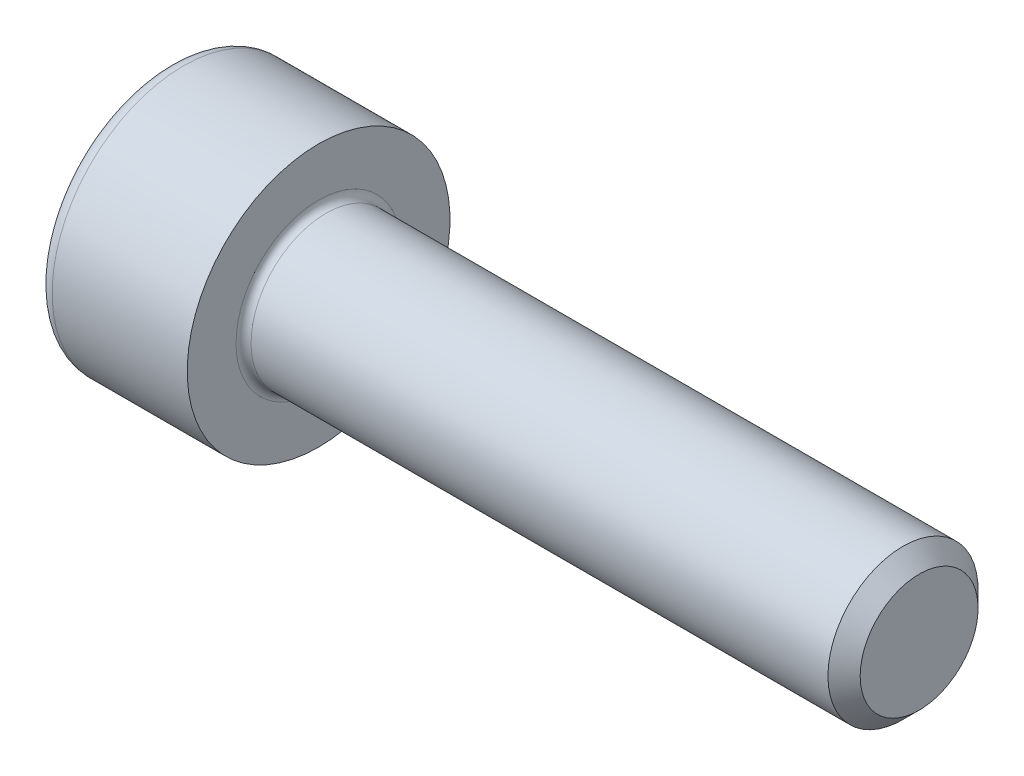
ISO-10303-21;
HEADER;
FILE_DESCRIPTION(('STEP AP214'),'2;1');
FILE_NAME('part.step','',(''),(''),'','','');
FILE_SCHEMA(('AUTOMOTIVE_DESIGN { 1 0 10303 214 1 1 1 1 }'));
ENDSEC;
DATA;
#1=APPLICATION_CONTEXT('core data for automotive mechanical design processes');
#2=APPLICATION_PROTOCOL_DEFINITION('international standard','automotive_design',2000,#1);
#3=PRODUCT_CONTEXT('',#1,'mechanical');
#4=PRODUCT('Part','Part','',(#3));
#5=PRODUCT_RELATED_PRODUCT_CATEGORY('part','',(#4));
#6=PRODUCT_DEFINITION_FORMATION('','',#4);
#7=PRODUCT_DEFINITION_CONTEXT('part definition',#1,'design');
#8=PRODUCT_DEFINITION('design','',#6,#7);
#9=PRODUCT_DEFINITION_SHAPE('','',#8);
#10=(LENGTH_UNIT() NAMED_UNIT(*) SI_UNIT(.MILLI.,.METRE.));
#11=(NAMED_UNIT(*) PLANE_ANGLE_UNIT() SI_UNIT($,.RADIAN.));
#12=(NAMED_UNIT(*) SI_UNIT($,.STERADIAN.) SOLID_ANGLE_UNIT());
#13=UNCERTAINTY_MEASURE_WITH_UNIT(LENGTH_MEASURE(1.E-05),#10,'distance_accuracy_value','');
#14=(GEOMETRIC_REPRESENTATION_CONTEXT(3) GLOBAL_UNCERTAINTY_ASSIGNED_CONTEXT((#13)) GLOBAL_UNIT_ASSIGNED_CONTEXT((#10,
#11,#12)) REPRESENTATION_CONTEXT('',''));
#15=CARTESIAN_POINT('',(0.,0.,0.));
#16=DIRECTION('',(0.,0.,1.));
#17=DIRECTION('',(1.,0.,0.));
#18=AXIS2_PLACEMENT_3D('',#15,#16,#17);
#19=CARTESIAN_POINT('',(-3.99999999999999,1.5,0.866025403784437));
#20=DIRECTION('',(0.,1.,0.));
#21=DIRECTION('',(0.,0.,1.));
#22=AXIS2_PLACEMENT_3D('',#19,#20,#21);
#23=PLANE('',#22);
#24=DIRECTION('',(0.,0.,1.));
#25=VECTOR('',#24,1.);
#26=CARTESIAN_POINT('',(-3.99999999999999,1.5,0.866025403784437));
#27=LINE('',#26,#25);
#28=CARTESIAN_POINT('',(-3.99999999999999,1.5,-0.86602540378444));
#29=VERTEX_POINT('',#28);
#30=CARTESIAN_POINT('',(-3.99999999999999,1.50000001434973,0.86602539549962));
#31=VERTEX_POINT('',#30);
#32=EDGE_CURVE('E70',#29,#31,#27,.T.);
#33=ORIENTED_EDGE('',*,*,#32,.F.);
#34=DIRECTION('',(1.,0.,0.));
#35=VECTOR('',#34,1.);
#36=CARTESIAN_POINT('',(-3.99999999999999,1.5,-0.86602540378444));
#37=LINE('',#36,#35);
#38=CARTESIAN_POINT('',(-2.00000000622813,1.5,-0.866025425314682));
#39=VERTEX_POINT('',#38);
#40=EDGE_CURVE('E127',#29,#39,#37,.T.);
#41=ORIENTED_EDGE('',*,*,#40,.T.);
#42=CARTESIAN_POINT('',(-2.00000001244337,1.5,-0.866025446844923));
#43=CARTESIAN_POINT('',(-1.97802167027363,1.5,-0.789912302852927));
#44=CARTESIAN_POINT('',(-1.9580335181738,1.5,-0.713142151286127));
#45=CARTESIAN_POINT('',(-1.92314479865285,1.5,-0.558272624278191));
#46=CARTESIAN_POINT('',(-1.9082565721912,1.5,-0.480170498000679));
#47=CARTESIAN_POINT('',(-1.88508197381883,1.5,-0.324934125856235));
#48=CARTESIAN_POINT('',(-1.87664134414548,1.5,-0.247823758405713));
#49=CARTESIAN_POINT('',(-1.86656687731368,1.5,-0.0932403829492778));
#50=CARTESIAN_POINT('',(-1.8649246956255,1.5,-0.015767936426523));
#51=CARTESIAN_POINT('',(-1.86834971575511,1.5,0.128981011060547));
#52=CARTESIAN_POINT('',(-1.87257596047736,1.5,0.196279232790937));
#53=CARTESIAN_POINT('',(-1.88596796804727,1.5,0.330437250414616));
#54=CARTESIAN_POINT('',(-1.89513830110027,1.5,0.397296582637759));
#55=CARTESIAN_POINT('',(-1.91806235931432,1.5,0.531730978506836));
#56=CARTESIAN_POINT('',(-1.93191321271813,1.5,0.599289036254629));
#57=CARTESIAN_POINT('',(-1.96334879473343,1.5,0.733397814913492));
#58=CARTESIAN_POINT('',(-1.98092614197712,1.5,0.79995025258687));
#59=CARTESIAN_POINT('',(-1.99999996661989,1.5,0.866025288107723));
#60=B_SPLINE_CURVE_WITH_KNOTS('',3,(#42,#43,#44,#45,#46,#47,#48,#49,#50,#51,#52,#53,#54,#55,#56,
#57,#58,#59),.UNSPECIFIED.,.F.,.F.,(4,2,2,2,2,2,2,2,4),(0.,0.237762011469281,0.47609536843425,
0.708530713118473,0.940680677999537,1.14278082713907,1.34506811427312,1.55184116347492,
1.75820840460591),.UNSPECIFIED.);
#61=CARTESIAN_POINT('',(-1.99999999088358,1.50000002270158,0.866025332839321));
#62=VERTEX_POINT('',#61);
#63=EDGE_CURVE('E63',#39,#62,#60,.T.);
#64=ORIENTED_EDGE('',*,*,#63,.T.);
#65=DIRECTION('',(1.,0.,0.));
#66=VECTOR('',#65,1.);
#67=CARTESIAN_POINT('',(-3.99999999999999,1.50000002152459,0.866025391357211));
#68=LINE('',#67,#66);
#69=EDGE_CURVE('E136',#62,#31,#68,.F.);
#70=ORIENTED_EDGE('',*,*,#69,.T.);
#71=EDGE_LOOP('',(#33,#41,#64,#70));
#72=FACE_BOUND('',#71,.T.);
#73=ADVANCED_FACE('F17',(#72),#23,.F.);
#74=CARTESIAN_POINT('',(-3.99999999999999,0.,1.73205080756888));
#75=DIRECTION('',(0.,0.500000000000001,0.866025403784438));
#76=DIRECTION('',(0.,-0.866025403784438,0.500000000000001));
#77=AXIS2_PLACEMENT_3D('',#74,#75,#76);
#78=PLANE('',#77);
#79=DIRECTION('',(0.,-0.866025403784438,0.500000000000001));
#80=VECTOR('',#79,1.);
#81=CARTESIAN_POINT('',(-3.99999999999999,0.,1.73205080756888));
#82=LINE('',#81,#80);
#83=CARTESIAN_POINT('',(-3.99999999999999,2.367900377615E-09,1.73205080893599));
#84=VERTEX_POINT('',#83);
#85=EDGE_CURVE('E138',#31,#84,#82,.T.);
#86=ORIENTED_EDGE('',*,*,#85,.F.);
#87=ORIENTED_EDGE('',*,*,#69,.F.);
#88=CARTESIAN_POINT('',(-1.99999999914628,2.59982219753588E-09,1.73205080606787));
#89=CARTESIAN_POINT('',(-1.97802165804949,0.065915918243952,1.69399423442685));
#90=CARTESIAN_POINT('',(-1.95803350709377,0.132400819134735,1.65560915900051));
#91=CARTESIAN_POINT('',(-1.92314478995667,0.266521762501426,1.57817439624379));
#92=CARTESIAN_POINT('',(-1.90825656473387,0.334160187271199,1.5391233334954));
#93=CARTESIAN_POINT('',(-1.88508196884754,0.46859882769027,1.46150514825996));
#94=CARTESIAN_POINT('',(-1.87664134041704,0.535378364025733,1.42294996498032));
#95=CARTESIAN_POINT('',(-1.86656687597428,0.669251492536777,1.34565827819721));
#96=CARTESIAN_POINT('',(-1.86492469543271,0.736344598453817,1.30692205543524));
#97=CARTESIAN_POINT('',(-1.86834971778716,0.861700872504675,1.23454757686737));
#98=CARTESIAN_POINT('',(-1.87257596451876,0.919982851361971,1.20089846068521));
#99=CARTESIAN_POINT('',(-1.88596797752577,1.03616712096001,1.13381944135718));
#100=CARTESIAN_POINT('',(-1.89513831400995,1.09406901015022,1.10038977004662));
#101=CARTESIAN_POINT('',(-1.91806238026255,1.21049263030154,1.03317256161222));
#102=CARTESIAN_POINT('',(-1.93191323831751,1.2689996337133,0.99939352744297));
#103=CARTESIAN_POINT('',(-1.96334883035755,1.38514126089747,0.932339127724068));
#104=CARTESIAN_POINT('',(-1.98092618296969,1.44277737143093,0.899062903792528));
#105=CARTESIAN_POINT('',(-2.00000001316396,1.50000003945322,0.866025381006112));
#106=B_SPLINE_CURVE_WITH_KNOTS('',3,(#88,#89,#90,#91,#92,#93,#94,#95,#96,#97,#98,#99,#100,#101,
#102,#103,#104,#105),.UNSPECIFIED.,.F.,.F.,(4,2,2,2,2,2,2,2,4),(0.,0.237762008525205,
0.476095362486668,0.708530704105071,0.940680665935181,1.14278084719831,1.3450681665734,
1.55184124967058,1.75820852442755),.UNSPECIFIED.);
#107=CARTESIAN_POINT('',(-2.00000000026003,2.1878736345942E-09,1.7320508079118));
#108=VERTEX_POINT('',#107);
#109=EDGE_CURVE('E139',#108,#62,#106,.T.);
#110=ORIENTED_EDGE('',*,*,#109,.F.);
#111=DIRECTION('',(1.,0.,0.));
#112=VECTOR('',#111,1.);
#113=CARTESIAN_POINT('',(-3.99999999999999,3.55185022019033E-09,1.73205080961954));
#114=LINE('',#113,#112);
#115=EDGE_CURVE('E118',#108,#84,#114,.F.);
#116=ORIENTED_EDGE('',*,*,#115,.T.);
#117=EDGE_LOOP('',(#86,#87,#110,#116));
#118=FACE_BOUND('',#117,.T.);
#119=ADVANCED_FACE('F200',(#118),#78,.F.);
#120=CARTESIAN_POINT('',(-3.99999999999999,1.5,-0.86602540378444));
#121=DIRECTION('',(0.,0.5,-0.866025403784439));
#122=DIRECTION('',(0.,0.866025403784439,0.5));
#123=AXIS2_PLACEMENT_3D('',#120,#121,#122);
#124=PLANE('',#123);
#125=DIRECTION('',(0.,0.866025403784439,0.5));
#126=VECTOR('',#125,1.);
#127=CARTESIAN_POINT('',(-3.99999999999999,1.5,-0.86602540378444));
#128=LINE('',#127,#126);
#129=CARTESIAN_POINT('',(-3.99999999999999,0.,-1.73205080756888));
#130=VERTEX_POINT('',#129);
#131=EDGE_CURVE('E129',#130,#29,#128,.T.);
#132=ORIENTED_EDGE('',*,*,#131,.F.);
#133=DIRECTION('',(1.,0.,0.));
#134=VECTOR('',#133,1.);
#135=CARTESIAN_POINT('',(-3.99999999999999,0.,-1.73205080756888));
#136=LINE('',#135,#134);
#137=CARTESIAN_POINT('',(-1.99999999617477,-2.59634794172114E-08,-1.73205080091443));
#138=VERTEX_POINT('',#137);
#139=EDGE_CURVE('E91',#130,#138,#136,.T.);
#140=ORIENTED_EDGE('',*,*,#139,.T.);
#141=CARTESIAN_POINT('',(-1.9999999845922,1.49999999398787,-0.86602542611703));
#142=CARTESIAN_POINT('',(-1.97802165051845,1.4340840727152,-0.904081988920401));
#143=CARTESIAN_POINT('',(-1.95803350279868,1.36759917014035,-0.942467060360441));
#144=CARTESIAN_POINT('',(-1.92314478868745,1.23347822682247,-1.01990181945342));
#145=CARTESIAN_POINT('',(-1.90825656325272,1.16583980379276,-1.05895288253534));
#146=CARTESIAN_POINT('',(-1.88508196765766,1.0314011657448,-1.1365710673535));
#147=CARTESIAN_POINT('',(-1.87664133972764,0.964621630060405,-1.17512624991262));
#148=CARTESIAN_POINT('',(-1.86656687589348,0.830748503150797,-1.25241793552079));
#149=CARTESIAN_POINT('',(-1.86492469545695,0.763655398184009,-1.29115415782786));
#150=CARTESIAN_POINT('',(-1.86834971786763,0.638299126711335,-1.3635286349659));
#151=CARTESIAN_POINT('',(-1.87257596448773,0.580017149488175,-1.39717775018464));
#152=CARTESIAN_POINT('',(-1.88596797698761,0.463832883127097,-1.46425676762908));
#153=CARTESIAN_POINT('',(-1.89513831307738,0.405930995539829,-1.49768643801942));
#154=CARTESIAN_POINT('',(-1.91806237829272,0.289507378725879,-1.56490364453128));
#155=CARTESIAN_POINT('',(-1.9319132356891,0.231000377045831,-1.59868267769965));
#156=CARTESIAN_POINT('',(-1.9633488262329,0.114858753294707,-1.66573707543431));
#157=CARTESIAN_POINT('',(-1.98092617800633,0.0572226444623958,-1.69901329838261));
#158=CARTESIAN_POINT('',(-2.00000000730664,-2.18812601356191E-08,-1.73205082020203));
#159=B_SPLINE_CURVE_WITH_KNOTS('',3,(#141,#142,#143,#144,#145,#146,#147,#148,#149,#150,#151,
#152,#153,#154,#155,#156,#157,#158),.UNSPECIFIED.,.F.,.F.,(4,2,2,2,2,2,2,2,4),(0.,
0.237762004552964,0.476095354829307,0.70853069345683,0.940680652177095,1.14278082774665,
1.34506814148363,1.551841218313,1.75820848673769),.UNSPECIFIED.);
#160=EDGE_CURVE('E133',#39,#138,#159,.T.);
#161=ORIENTED_EDGE('',*,*,#160,.F.);
#162=ORIENTED_EDGE('',*,*,#40,.F.);
#163=EDGE_LOOP('',(#132,#140,#161,#162));
#164=FACE_BOUND('',#163,.T.);
#165=ADVANCED_FACE('F176',(#164),#124,.F.);
#166=CARTESIAN_POINT('',(-2.00599999760698,0.,0.));
#167=DIRECTION('',(-1.,0.,0.));
#168=DIRECTION('',(0.,0.,1.));
#169=AXIS2_PLACEMENT_3D('',#166,#167,#168);
#170=CONICAL_SURFACE('',#169,1.74244310824179,1.04719755104308);
#171=CARTESIAN_POINT('',(-0.999999999692136,0.,0.));
#172=VERTEX_POINT('',#171);
#173=VERTEX_LOOP('',#172);
#174=FACE_BOUND('',#173,.T.);
#175=ORIENTED_EDGE('',*,*,#160,.T.);
#176=CARTESIAN_POINT('',(-1.99999998854951,-3.4393004361321E-08,-1.73205078771207));
#177=CARTESIAN_POINT('',(-1.97802164832238,-0.0659159495029796,-1.69399421637945));
#178=CARTESIAN_POINT('',(-1.95803349829056,-0.132400849856189,-1.65560914126347));
#179=CARTESIAN_POINT('',(-1.9231447830714,-0.266521792095019,-1.57817437915792));
#180=CARTESIAN_POINT('',(-1.90825655884144,-0.334160216274167,-1.53912331675053));
#181=CARTESIAN_POINT('',(-1.88508196491939,-0.468598855530329,-1.46150513218649));
#182=CARTESIAN_POINT('',(-1.87664133746583,-0.535378391295809,-1.42294994923594));
#183=CARTESIAN_POINT('',(-1.86656687491075,-0.669251518600716,-1.34565826314919));
#184=CARTESIAN_POINT('',(-1.86492469528071,-0.736344623881734,-1.30692204075443));
#185=CARTESIAN_POINT('',(-1.86834971909229,-0.861700893169495,-1.23454756493653));
#186=CARTESIAN_POINT('',(-1.8725759660724,-0.919982867914978,-1.20089845112832));
#187=CARTESIAN_POINT('',(-1.88596797884558,-1.03616712931713,-1.1338194365322));
#188=CARTESIAN_POINT('',(-1.89513831484576,-1.09406901442338,-1.10038976757951));
#189=CARTESIAN_POINT('',(-1.91806237947953,-1.21049262628681,-1.03317256393013));
#190=CARTESIAN_POINT('',(-1.93191323637644,-1.26899962549818,-0.99939353218597));
#191=CARTESIAN_POINT('',(-1.96334882561811,-1.38514124442257,-0.932339137235854));
#192=CARTESIAN_POINT('',(-1.98092617659227,-1.44277735089615,-0.899062915648294));
#193=CARTESIAN_POINT('',(-2.00000000498686,-1.50000001491904,-0.86602539517093));
#194=B_SPLINE_CURVE_WITH_KNOTS('',3,(#176,#177,#178,#179,#180,#181,#182,#183,#184,#185,#186,
#187,#188,#189,#190,#191,#192,#193),.UNSPECIFIED.,.F.,.F.,(4,2,2,2,2,2,2,2,4),(0.,
0.237762006020151,0.476095357408816,0.708530696745233,0.940680656319995,1.14278082345989,
1.34506812865837,1.55184119682688,1.75820845675985),.UNSPECIFIED.);
#195=CARTESIAN_POINT('',(-2.00000000277248,-1.5000000082759,-0.866025399006347));
#196=VERTEX_POINT('',#195);
#197=EDGE_CURVE('E94',#138,#196,#194,.T.);
#198=ORIENTED_EDGE('',*,*,#197,.T.);
#199=CARTESIAN_POINT('',(-1.99999998964158,-1.5,-0.866025367853856));
#200=CARTESIAN_POINT('',(-1.97802164932501,-1.5,-0.789912225125676));
#201=CARTESIAN_POINT('',(-1.95803349919813,-1.5,-0.713142074830405));
#202=CARTESIAN_POINT('',(-1.92314478378155,-1.5,-0.558272550486464));
#203=CARTESIAN_POINT('',(-1.90825655944935,-1.5,-0.480170425602137));
#204=CARTESIAN_POINT('',(-1.88508196532467,-1.5,-0.324934056335809));
#205=CARTESIAN_POINT('',(-1.87664133777027,-1.5,-0.247823690366227));
#206=CARTESIAN_POINT('',(-1.86656687502047,-1.5,-0.0932403180478142));
#207=CARTESIAN_POINT('',(-1.86492469529647,-1.5,-0.0157678731818456));
#208=CARTESIAN_POINT('',(-1.86834971895399,-1.5,0.128981078857912));
#209=CARTESIAN_POINT('',(-1.8725759658918,-1.5,0.196279306800386));
#210=CARTESIAN_POINT('',(-1.88596797863271,-1.5,0.330437336644172));
#211=CARTESIAN_POINT('',(-1.89513831464304,-1.5,0.397296674875003));
#212=CARTESIAN_POINT('',(-1.91806237934458,-1.5,0.531731082835251));
#213=CARTESIAN_POINT('',(-1.93191323630077,-1.5,0.599289146659335));
#214=CARTESIAN_POINT('',(-1.96334882569767,-1.5,0.733397937220282));
#215=CARTESIAN_POINT('',(-1.98092617676759,-1.5,0.799950380720394));
#216=CARTESIAN_POINT('',(-2.00000000527082,-1.5,0.866025421995132));
#217=B_SPLINE_CURVE_WITH_KNOTS('',3,(#199,#200,#201,#202,#203,#204,#205,#206,#207,#208,#209,
#210,#211,#212,#213,#214,#215,#216),.UNSPECIFIED.,.F.,.F.,(4,2,2,2,2,2,2,2,4),(0.,
0.237762006276336,0.476095357927914,0.708530697501479,0.940680657310826,1.14278082541578,
1.34506813158302,1.55184120077223,1.75820846171905),.UNSPECIFIED.);
#218=CARTESIAN_POINT('',(-1.99999999857922,-1.49999998741893,0.866025420605798));
#219=VERTEX_POINT('',#218);
#220=EDGE_CURVE('E101',#196,#219,#217,.T.);
#221=ORIENTED_EDGE('',*,*,#220,.T.);
#222=CARTESIAN_POINT('',(-1.99999999162647,-1.49999997483786,0.866025418311807));
#223=CARTESIAN_POINT('',(-1.97802165114913,-1.43408405957977,0.904081989729948));
#224=CARTESIAN_POINT('',(-1.95803350085096,-1.36759915907753,0.942467064931958));
#225=CARTESIAN_POINT('',(-1.92314478507779,-1.23347821652645,1.01990182721779));
#226=CARTESIAN_POINT('',(-1.90825656056043,-1.165839792184,1.05895288971947));
#227=CARTESIAN_POINT('',(-1.88508196606536,-1.03140115259142,1.13657107447773));
#228=CARTESIAN_POINT('',(-1.87664133832601,-0.964621616653315,1.17512625752795));
#229=CARTESIAN_POINT('',(-1.86656687522027,-0.830748488982654,1.25241794382587));
#230=CARTESIAN_POINT('',(-1.86492469532522,-0.763655383508541,1.29115416633211));
#231=CARTESIAN_POINT('',(-1.86834971866381,-0.638299114641996,1.36352864190682));
#232=CARTESIAN_POINT('',(-1.87257596535809,-0.580017140511367,1.39717775536004));
#233=CARTESIAN_POINT('',(-1.88596797747781,-0.463832880316925,1.4642567692589));
#234=CARTESIAN_POINT('',(-1.89513831311015,-0.405930995803486,1.49768643786932));
#235=CARTESIAN_POINT('',(-1.91806237694638,-0.289507385132021,1.56490364083052));
#236=CARTESIAN_POINT('',(-1.93191323341113,-0.231000386519066,1.59868267222919));
#237=CARTESIAN_POINT('',(-1.9633488217614,-0.114858768766295,1.66573706650287));
#238=CARTESIAN_POINT('',(-1.98092617227665,-0.0572226628660193,1.69901328775943));
#239=CARTESIAN_POINT('',(-2.00000000021071,5.90576722082473E-10,1.73205080790985));
#240=B_SPLINE_CURVE_WITH_KNOTS('',3,(#222,#223,#224,#225,#226,#227,#228,#229,#230,#231,#232,
#233,#234,#235,#236,#237,#238,#239),.UNSPECIFIED.,.F.,.F.,(4,2,2,2,2,2,2,2,4),(0.,
0.23776200672242,0.476095358829804,0.708530698854279,0.940680659111702,1.14278082407781,
1.34506812709478,1.55184119297312,1.75820845063596),.UNSPECIFIED.);
#241=EDGE_CURVE('E121',#219,#108,#240,.T.);
#242=ORIENTED_EDGE('',*,*,#241,.T.);
#243=ORIENTED_EDGE('',*,*,#109,.T.);
#244=ORIENTED_EDGE('',*,*,#63,.F.);
#245=EDGE_LOOP('',(#175,#198,#221,#242,#243,#244));
#246=FACE_BOUND('',#245,.T.);
#247=ADVANCED_FACE('F170',(#174,#246),#170,.F.);
#248=CARTESIAN_POINT('',(-3.99999999999999,-1.5,0.866025403784439));
#249=DIRECTION('',(0.,-0.5,0.866025403784439));
#250=DIRECTION('',(0.,-0.866025403784439,-0.5));
#251=AXIS2_PLACEMENT_3D('',#248,#249,#250);
#252=PLANE('',#251);
#253=DIRECTION('',(0.,-0.866025403784439,-0.5));
#254=VECTOR('',#253,1.);
#255=CARTESIAN_POINT('',(-3.99999999999999,-1.5,0.866025403784439));
#256=LINE('',#255,#254);
#257=CARTESIAN_POINT('',(-3.99999999999999,-1.49999999730995,0.866025417762366));
#258=VERTEX_POINT('',#257);
#259=EDGE_CURVE('E106',#84,#258,#256,.T.);
#260=ORIENTED_EDGE('',*,*,#259,.F.);
#261=ORIENTED_EDGE('',*,*,#115,.F.);
#262=ORIENTED_EDGE('',*,*,#241,.F.);
#263=DIRECTION('',(1.,0.,0.));
#264=VECTOR('',#263,1.);
#265=CARTESIAN_POINT('',(-3.99999999999999,-1.5,0.866025428634087));
#266=LINE('',#265,#264);
#267=EDGE_CURVE('E102',#219,#258,#266,.F.);
#268=ORIENTED_EDGE('',*,*,#267,.T.);
#269=EDGE_LOOP('',(#260,#261,#262,#268));
#270=FACE_BOUND('',#269,.T.);
#271=ADVANCED_FACE('F175',(#270),#252,.F.);
#272=CARTESIAN_POINT('',(-3.99999999999999,0.,-1.73205080756888));
#273=DIRECTION('',(0.,-0.5,-0.866025403784439));
#274=DIRECTION('',(0.,0.866025403784439,-0.5));
#275=AXIS2_PLACEMENT_3D('',#272,#273,#274);
#276=PLANE('',#275);
#277=DIRECTION('',(0.,0.866025403784439,-0.5));
#278=VECTOR('',#277,1.);
#279=CARTESIAN_POINT('',(-3.99999999999999,0.,-1.73205080756888));
#280=LINE('',#279,#278);
#281=CARTESIAN_POINT('',(-3.99999999999999,-1.5,-0.86602540378444));
#282=VERTEX_POINT('',#281);
#283=EDGE_CURVE('E84',#282,#130,#280,.T.);
#284=ORIENTED_EDGE('',*,*,#283,.F.);
#285=DIRECTION('',(1.,0.,0.));
#286=VECTOR('',#285,1.);
#287=CARTESIAN_POINT('',(-3.99999999999999,-1.5,-0.86602540378444));
#288=LINE('',#287,#286);
#289=EDGE_CURVE('E88',#282,#196,#288,.T.);
#290=ORIENTED_EDGE('',*,*,#289,.T.);
#291=ORIENTED_EDGE('',*,*,#197,.F.);
#292=ORIENTED_EDGE('',*,*,#139,.F.);
#293=EDGE_LOOP('',(#284,#290,#291,#292));
#294=FACE_BOUND('',#293,.T.);
#295=ADVANCED_FACE('F86',(#294),#276,.F.);
#296=CARTESIAN_POINT('',(-3.99999999999999,-1.5,-0.866025403784438));
#297=DIRECTION('',(0.,-1.,0.));
#298=DIRECTION('',(0.,0.,-1.));
#299=AXIS2_PLACEMENT_3D('',#296,#297,#298);
#300=PLANE('',#299);
#301=DIRECTION('',(0.,0.,1.));
#302=VECTOR('',#301,1.);
#303=CARTESIAN_POINT('',(-3.99999999999999,-1.5,0.));
#304=LINE('',#303,#302);
#305=EDGE_CURVE('E100',#258,#282,#304,.F.);
#306=ORIENTED_EDGE('',*,*,#305,.F.);
#307=ORIENTED_EDGE('',*,*,#267,.F.);
#308=ORIENTED_EDGE('',*,*,#220,.F.);
#309=ORIENTED_EDGE('',*,*,#289,.F.);
#310=EDGE_LOOP('',(#306,#307,#308,#309));
#311=FACE_BOUND('',#310,.T.);
#312=ADVANCED_FACE('F98',(#311),#300,.F.);
#313=CARTESIAN_POINT('',(-3.99999999999999,2.61602540378444,0.));
#314=DIRECTION('',(-1.,0.,0.));
#315=DIRECTION('',(0.,-1.,0.));
#316=AXIS2_PLACEMENT_3D('',#313,#314,#315);
#317=PLANE('',#316);
#318=CARTESIAN_POINT('',(-3.99999999999999,0.,0.));
#319=DIRECTION('',(1.,0.,0.));
#320=DIRECTION('',(0.,1.,0.));
#321=AXIS2_PLACEMENT_3D('',#318,#319,#320);
#322=CIRCLE('',#321,3.1);
#323=CARTESIAN_POINT('',(-3.99999999999999,3.1,0.));
#324=VERTEX_POINT('',#323);
#325=EDGE_CURVE('E108',#324,#324,#322,.T.);
#326=ORIENTED_EDGE('',*,*,#325,.F.);
#327=EDGE_LOOP('',(#326));
#328=FACE_BOUND('',#327,.T.);
#329=ORIENTED_EDGE('',*,*,#259,.T.);
#330=ORIENTED_EDGE('',*,*,#305,.T.);
#331=ORIENTED_EDGE('',*,*,#283,.T.);
#332=ORIENTED_EDGE('',*,*,#131,.T.);
#333=ORIENTED_EDGE('',*,*,#32,.T.);
#334=ORIENTED_EDGE('',*,*,#85,.T.);
#335=EDGE_LOOP('',(#329,#330,#331,#332,#333,#334));
#336=FACE_BOUND('',#335,.T.);
#337=ADVANCED_FACE('F104',(#328,#336),#317,.T.);
#338=CARTESIAN_POINT('',(-3.59999999999999,0.,0.));
#339=DIRECTION('',(1.,0.,0.));
#340=DIRECTION('',(0.,1.,0.));
#341=AXIS2_PLACEMENT_3D('',#338,#339,#340);
#342=TOROIDAL_SURFACE('',#341,3.1,0.4);
#343=CARTESIAN_POINT('',(-3.59999999999999,0.,0.));
#344=DIRECTION('',(1.,0.,0.));
#345=DIRECTION('',(0.,1.,0.));
#346=AXIS2_PLACEMENT_3D('',#343,#344,#345);
#347=CIRCLE('',#346,3.5);
#348=CARTESIAN_POINT('',(-3.59999999999999,3.5,0.));
#349=VERTEX_POINT('',#348);
#350=EDGE_CURVE('E111',#349,#349,#347,.T.);
#351=ORIENTED_EDGE('',*,*,#350,.F.);
#352=EDGE_LOOP('',(#351));
#353=FACE_BOUND('',#352,.T.);
#354=ORIENTED_EDGE('',*,*,#325,.T.);
#355=EDGE_LOOP('',(#354));
#356=FACE_BOUND('',#355,.T.);
#357=ADVANCED_FACE('F251',(#353,#356),#342,.T.);
#358=CARTESIAN_POINT('',(-2.,0.,0.));
#359=DIRECTION('',(1.,0.,0.));
#360=DIRECTION('',(0.,1.,0.));
#361=AXIS2_PLACEMENT_3D('',#358,#359,#360);
#362=CYLINDRICAL_SURFACE('',#361,3.5);
#363=ORIENTED_EDGE('',*,*,#350,.T.);
#364=EDGE_LOOP('',(#363));
#365=FACE_BOUND('',#364,.T.);
#366=CARTESIAN_POINT('',(0.,0.,0.));
#367=DIRECTION('',(1.,0.,0.));
#368=DIRECTION('',(0.,1.,0.));
#369=AXIS2_PLACEMENT_3D('',#366,#367,#368);
#370=CIRCLE('',#369,3.5);
#371=CARTESIAN_POINT('',(0.,3.5,0.));
#372=VERTEX_POINT('',#371);
#373=EDGE_CURVE('E151',#372,#372,#370,.T.);
#374=ORIENTED_EDGE('',*,*,#373,.F.);
#375=EDGE_LOOP('',(#374));
#376=FACE_BOUND('',#375,.T.);
#377=ADVANCED_FACE('F246',(#365,#376),#362,.T.);
#378=CARTESIAN_POINT('',(0.,2.75,0.));
#379=DIRECTION('',(1.,0.,0.));
#380=DIRECTION('',(0.,1.,0.));
#381=AXIS2_PLACEMENT_3D('',#378,#379,#380);
#382=PLANE('',#381);
#383=ORIENTED_EDGE('',*,*,#373,.T.);
#384=EDGE_LOOP('',(#383));
#385=FACE_BOUND('',#384,.T.);
#386=CARTESIAN_POINT('',(0.,0.,-2.2));
#387=CARTESIAN_POINT('',(0.,-0.418895795157256,-2.20010098873966));
#388=CARTESIAN_POINT('',(0.,-0.809808361036138,-2.04553426233734));
#389=CARTESIAN_POINT('',(0.,-1.23260972110365,-1.87835871504543));
#390=CARTESIAN_POINT('',(0.,-1.55563491861042,-1.55563491861039));
#391=CARTESIAN_POINT('',(0.,-1.87721690125167,-1.23435299043846));
#392=CARTESIAN_POINT('',(0.,-2.04553426233736,-0.809808361036092));
#393=CARTESIAN_POINT('',(0.,-2.19980415939092,-0.42069546234228));
#394=CARTESIAN_POINT('',(0.,-2.2,0.));
#395=CARTESIAN_POINT('',(0.,-2.20019489227907,0.418658305015612));
#396=CARTESIAN_POINT('',(0.,-2.04553426233734,0.809808361036148));
#397=CARTESIAN_POINT('',(0.,-1.87835871504608,1.23260972110349));
#398=CARTESIAN_POINT('',(0.,-1.55563491861039,1.55563491861042));
#399=CARTESIAN_POINT('',(0.,-1.23435299043857,1.87721690125108));
#400=CARTESIAN_POINT('',(0.,-0.809808361036109,2.04553426233735));
#401=CARTESIAN_POINT('',(0.,-0.420457168182669,2.19989863483954));
#402=CARTESIAN_POINT('',(0.,0.,2.2));
#403=B_SPLINE_CURVE_WITH_KNOTS('',2,(#386,#387,#388,#389,#390,#391,#392,#393,#394,#395,#396,
#397,#398,#399,#400,#401,#402),.UNSPECIFIED.,.F.,.F.,(3,2,2,2,2,2,2,2,3),(0.,0.125,0.25,0.375,
0.5,0.625,0.75,0.875,1.),.UNSPECIFIED.);
#404=CARTESIAN_POINT('',(0.,0.,-2.2));
#405=VERTEX_POINT('',#404);
#406=CARTESIAN_POINT('',(0.,0.,2.2));
#407=VERTEX_POINT('',#406);
#408=EDGE_CURVE('E34',#405,#407,#403,.T.);
#409=ORIENTED_EDGE('',*,*,#408,.T.);
#410=CARTESIAN_POINT('',(0.,0.,2.2));
#411=CARTESIAN_POINT('',(0.,0.418895795156226,2.20010098873966));
#412=CARTESIAN_POINT('',(0.,0.80980836103613,2.04553426233734));
#413=CARTESIAN_POINT('',(0.,1.23260972110275,1.87835871504624));
#414=CARTESIAN_POINT('',(0.,1.55563491861041,1.5556349186104));
#415=CARTESIAN_POINT('',(0.,1.87721703521521,1.23435285660001));
#416=CARTESIAN_POINT('',(0.,2.04553426233735,0.809808361036115));
#417=CARTESIAN_POINT('',(0.,2.19990569748039,0.420439167027688));
#418=CARTESIAN_POINT('',(0.,2.2,0.));
#419=CARTESIAN_POINT('',(0.,2.20009396033452,-0.418913566086053));
#420=CARTESIAN_POINT('',(0.,2.04553426233734,-0.809808361036127));
#421=CARTESIAN_POINT('',(0.,1.87835871823997,-1.23260971790604));
#422=CARTESIAN_POINT('',(0.,1.5556349186104,-1.55563491861041));
#423=CARTESIAN_POINT('',(0.,1.23435299043861,-1.87721690125162));
#424=CARTESIAN_POINT('',(0.,0.809808361036115,-2.04553426233735));
#425=CARTESIAN_POINT('',(0.,0.420457168181391,-2.19989863483953));
#426=CARTESIAN_POINT('',(0.,0.,-2.2));
#427=B_SPLINE_CURVE_WITH_KNOTS('',2,(#410,#411,#412,#413,#414,#415,#416,#417,#418,#419,#420,
#421,#422,#423,#424,#425,#426),.UNSPECIFIED.,.F.,.F.,(3,2,2,2,2,2,2,2,3),(0.,0.125,0.25,0.375,
0.5,0.625,0.75,0.875,1.),.UNSPECIFIED.);
#428=EDGE_CURVE('E154',#407,#405,#427,.T.);
#429=ORIENTED_EDGE('',*,*,#428,.T.);
#430=EDGE_LOOP('',(#409,#429));
#431=FACE_BOUND('',#430,.T.);
#432=ADVANCED_FACE('F235',(#385,#431),#382,.T.);
#433=CARTESIAN_POINT('',(16.,1.,0.));
#434=DIRECTION('',(1.,0.,0.));
#435=DIRECTION('',(0.,1.,0.));
#436=AXIS2_PLACEMENT_3D('',#433,#434,#435);
#437=PLANE('',#436);
#438=CARTESIAN_POINT('',(16.0000000000764,0.,0.));
#439=DIRECTION('',(-1.,0.,0.));
#440=DIRECTION('',(0.,0.,1.));
#441=AXIS2_PLACEMENT_3D('',#438,#439,#440);
#442=CIRCLE('',#441,1.57058500002449);
#443=CARTESIAN_POINT('',(16.0000000000764,0.,1.57058500002449));
#444=VERTEX_POINT('',#443);
#445=EDGE_CURVE('E148',#444,#444,#442,.T.);
#446=ORIENTED_EDGE('',*,*,#445,.F.);
#447=EDGE_LOOP('',(#446));
#448=FACE_BOUND('',#447,.T.);
#449=ADVANCED_FACE('F245',(#448),#437,.T.);
#450=CARTESIAN_POINT('',(0.200000000000002,0.,0.));
#451=DIRECTION('',(1.,0.,0.));
#452=DIRECTION('',(0.,1.,0.));
#453=AXIS2_PLACEMENT_3D('',#450,#451,#452);
#454=TOROIDAL_SURFACE('',#453,2.2,0.2);
#455=ORIENTED_EDGE('',*,*,#408,.F.);
#456=ORIENTED_EDGE('',*,*,#428,.F.);
#457=EDGE_LOOP('',(#455,#456));
#458=FACE_BOUND('',#457,.T.);
#459=CARTESIAN_POINT('',(0.200000000000002,0.,0.));
#460=DIRECTION('',(1.,0.,0.));
#461=DIRECTION('',(0.,1.,0.));
#462=AXIS2_PLACEMENT_3D('',#459,#460,#461);
#463=CIRCLE('',#462,2.);
#464=CARTESIAN_POINT('',(0.200000000000002,2.,0.));
#465=VERTEX_POINT('',#464);
#466=EDGE_CURVE('E21',#465,#465,#463,.T.);
#467=ORIENTED_EDGE('',*,*,#466,.F.);
#468=EDGE_LOOP('',(#467));
#469=FACE_BOUND('',#468,.T.);
#470=ADVANCED_FACE('F19',(#458,#469),#454,.F.);
#471=CARTESIAN_POINT('',(15.5705850000345,0.,0.));
#472=DIRECTION('',(-1.,0.,0.));
#473=DIRECTION('',(0.,0.,1.));
#474=AXIS2_PLACEMENT_3D('',#471,#472,#473);
#475=CONICAL_SURFACE('',#474,2.00000000006639,0.785398163397448);
#476=CARTESIAN_POINT('',(15.570585,0.,0.));
#477=DIRECTION('',(1.,0.,0.));
#478=DIRECTION('',(0.,1.,0.));
#479=AXIS2_PLACEMENT_3D('',#476,#477,#478);
#480=CIRCLE('',#479,2.);
#481=CARTESIAN_POINT('',(15.570585,2.,0.));
#482=VERTEX_POINT('',#481);
#483=EDGE_CURVE('E11',#482,#482,#480,.F.);
#484=ORIENTED_EDGE('',*,*,#483,.F.);
#485=EDGE_LOOP('',(#484));
#486=FACE_BOUND('',#485,.T.);
#487=ORIENTED_EDGE('',*,*,#445,.T.);
#488=EDGE_LOOP('',(#487));
#489=FACE_BOUND('',#488,.T.);
#490=ADVANCED_FACE('F264',(#486,#489),#475,.T.);
#491=CARTESIAN_POINT('',(8.875,0.,0.));
#492=DIRECTION('',(1.,0.,0.));
#493=DIRECTION('',(0.,1.,0.));
#494=AXIS2_PLACEMENT_3D('',#491,#492,#493);
#495=CYLINDRICAL_SURFACE('',#494,2.);
#496=ORIENTED_EDGE('',*,*,#483,.T.);
#497=EDGE_LOOP('',(#496));
#498=FACE_BOUND('',#497,.T.);
#499=ORIENTED_EDGE('',*,*,#466,.T.);
#500=EDGE_LOOP('',(#499));
#501=FACE_BOUND('',#500,.T.);
#502=ADVANCED_FACE('F262',(#498,#501),#495,.T.);
#503=CLOSED_SHELL('',(#73,#119,#165,#247,#271,#295,#312,#337,#357,#377,#432,#449,#470,#490,#502));
#504=MANIFOLD_SOLID_BREP('B1',#503);
#505=ADVANCED_BREP_SHAPE_REPRESENTATION('',(#18,#504),#14);
#506=SHAPE_DEFINITION_REPRESENTATION(#9,#505);
ENDSEC;
END-ISO-10303-21;
